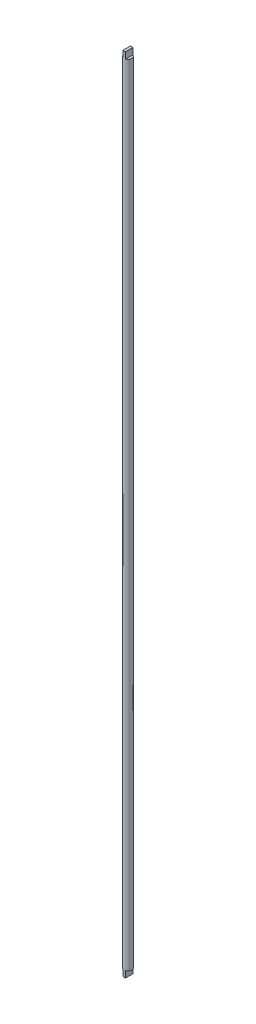
ISO-10303-21;
HEADER;
FILE_DESCRIPTION(('STEP AP214'),'2;1');
FILE_NAME('part.step','',(''),(''),'','','');
FILE_SCHEMA(('AUTOMOTIVE_DESIGN { 1 0 10303 214 1 1 1 1 }'));
ENDSEC;
DATA;
#1=APPLICATION_CONTEXT('core data for automotive mechanical design processes');
#2=APPLICATION_PROTOCOL_DEFINITION('international standard','automotive_design',2000,#1);
#3=PRODUCT_CONTEXT('',#1,'mechanical');
#4=PRODUCT('Part','Part','',(#3));
#5=PRODUCT_RELATED_PRODUCT_CATEGORY('part','',(#4));
#6=PRODUCT_DEFINITION_FORMATION('','',#4);
#7=PRODUCT_DEFINITION_CONTEXT('part definition',#1,'design');
#8=PRODUCT_DEFINITION('design','',#6,#7);
#9=PRODUCT_DEFINITION_SHAPE('','',#8);
#10=(LENGTH_UNIT() NAMED_UNIT(*) SI_UNIT(.MILLI.,.METRE.));
#11=(NAMED_UNIT(*) PLANE_ANGLE_UNIT() SI_UNIT($,.RADIAN.));
#12=(NAMED_UNIT(*) SI_UNIT($,.STERADIAN.) SOLID_ANGLE_UNIT());
#13=UNCERTAINTY_MEASURE_WITH_UNIT(LENGTH_MEASURE(1.E-05),#10,'distance_accuracy_value','');
#14=(GEOMETRIC_REPRESENTATION_CONTEXT(3) GLOBAL_UNCERTAINTY_ASSIGNED_CONTEXT((#13)) GLOBAL_UNIT_ASSIGNED_CONTEXT((#10,
#11,#12)) REPRESENTATION_CONTEXT('',''));
#15=CARTESIAN_POINT('',(0.,0.,0.));
#16=DIRECTION('',(0.,0.,1.));
#17=DIRECTION('',(1.,0.,0.));
#18=AXIS2_PLACEMENT_3D('',#15,#16,#17);
#19=CARTESIAN_POINT('',(0.,616.37,0.));
#20=DIRECTION('',(0.,-1.,0.));
#21=DIRECTION('',(0.,0.,-1.));
#22=AXIS2_PLACEMENT_3D('',#19,#20,#21);
#23=CYLINDRICAL_SURFACE('',#22,3.);
#24=CARTESIAN_POINT('',(0.,616.37,0.));
#25=DIRECTION('',(0.,1.,0.));
#26=DIRECTION('',(0.,0.,1.));
#27=AXIS2_PLACEMENT_3D('',#24,#25,#26);
#28=CIRCLE('',#27,3.);
#29=CARTESIAN_POINT('',(-1.,616.37,-2.82842712474619));
#30=VERTEX_POINT('',#29);
#31=CARTESIAN_POINT('',(-1.,616.37,2.82842712474619));
#32=VERTEX_POINT('',#31);
#33=EDGE_CURVE('E43',#30,#32,#28,.T.);
#34=ORIENTED_EDGE('',*,*,#33,.F.);
#35=DIRECTION('',(0.,-1.,0.));
#36=VECTOR('',#35,1.);
#37=CARTESIAN_POINT('',(-1.,621.37,-2.82842712474619));
#38=LINE('',#37,#36);
#39=CARTESIAN_POINT('',(-1.,621.37,-2.82842712474619));
#40=VERTEX_POINT('',#39);
#41=EDGE_CURVE('E143',#40,#30,#38,.T.);
#42=ORIENTED_EDGE('',*,*,#41,.F.);
#43=CARTESIAN_POINT('',(0.,621.37,0.));
#44=DIRECTION('',(0.,1.,0.));
#45=DIRECTION('',(0.,0.,1.));
#46=AXIS2_PLACEMENT_3D('',#43,#44,#45);
#47=CIRCLE('',#46,3.);
#48=CARTESIAN_POINT('',(1.,621.37,-2.82842712474619));
#49=VERTEX_POINT('',#48);
#50=EDGE_CURVE('E132',#49,#40,#47,.T.);
#51=ORIENTED_EDGE('',*,*,#50,.F.);
#52=DIRECTION('',(0.,-1.,0.));
#53=VECTOR('',#52,1.);
#54=CARTESIAN_POINT('',(1.,621.37,-2.82842712474619));
#55=LINE('',#54,#53);
#56=CARTESIAN_POINT('',(1.,616.37,-2.82842712474619));
#57=VERTEX_POINT('',#56);
#58=EDGE_CURVE('E146',#49,#57,#55,.T.);
#59=ORIENTED_EDGE('',*,*,#58,.T.);
#60=CARTESIAN_POINT('',(1.,616.37,2.82842712474619));
#61=VERTEX_POINT('',#60);
#62=EDGE_CURVE('E11',#61,#57,#28,.T.);
#63=ORIENTED_EDGE('',*,*,#62,.F.);
#64=DIRECTION('',(0.,-1.,0.));
#65=VECTOR('',#64,1.);
#66=CARTESIAN_POINT('',(1.,621.37,2.82842712474619));
#67=LINE('',#66,#65);
#68=CARTESIAN_POINT('',(1.,621.37,2.82842712474619));
#69=VERTEX_POINT('',#68);
#70=EDGE_CURVE('E149',#69,#61,#67,.T.);
#71=ORIENTED_EDGE('',*,*,#70,.F.);
#72=CARTESIAN_POINT('',(-1.,621.37,2.82842712474619));
#73=VERTEX_POINT('',#72);
#74=EDGE_CURVE('E127',#73,#69,#47,.T.);
#75=ORIENTED_EDGE('',*,*,#74,.F.);
#76=DIRECTION('',(0.,-1.,0.));
#77=VECTOR('',#76,1.);
#78=CARTESIAN_POINT('',(-1.,621.37,2.82842712474619));
#79=LINE('',#78,#77);
#80=EDGE_CURVE('E137',#73,#32,#79,.T.);
#81=ORIENTED_EDGE('',*,*,#80,.T.);
#82=EDGE_LOOP('',(#34,#42,#51,#59,#63,#71,#75,#81));
#83=FACE_BOUND('',#82,.T.);
#84=CARTESIAN_POINT('',(0.,-5.00000000000001,0.));
#85=DIRECTION('',(0.,-1.,0.));
#86=DIRECTION('',(0.,0.,-1.));
#87=AXIS2_PLACEMENT_3D('',#84,#85,#86);
#88=CIRCLE('',#87,3.);
#89=CARTESIAN_POINT('',(1.,-5.00000000000001,2.82842712474619));
#90=VERTEX_POINT('',#89);
#91=CARTESIAN_POINT('',(-1.,-5.00000000000001,2.82842712474619));
#92=VERTEX_POINT('',#91);
#93=EDGE_CURVE('E50',#90,#92,#88,.T.);
#94=ORIENTED_EDGE('',*,*,#93,.F.);
#95=DIRECTION('',(0.,1.,0.));
#96=VECTOR('',#95,1.);
#97=CARTESIAN_POINT('',(1.,-20.27,2.82842712474619));
#98=LINE('',#97,#96);
#99=CARTESIAN_POINT('',(1.,0.,2.82842712474619));
#100=VERTEX_POINT('',#99);
#101=EDGE_CURVE('E111',#90,#100,#98,.T.);
#102=ORIENTED_EDGE('',*,*,#101,.T.);
#103=CARTESIAN_POINT('',(0.,0.,0.));
#104=DIRECTION('',(0.,1.,0.));
#105=DIRECTION('',(0.,0.,1.));
#106=AXIS2_PLACEMENT_3D('',#103,#104,#105);
#107=CIRCLE('',#106,3.);
#108=CARTESIAN_POINT('',(1.,0.,-2.82842712474619));
#109=VERTEX_POINT('',#108);
#110=EDGE_CURVE('E38',#100,#109,#107,.T.);
#111=ORIENTED_EDGE('',*,*,#110,.T.);
#112=DIRECTION('',(0.,1.,0.));
#113=VECTOR('',#112,1.);
#114=CARTESIAN_POINT('',(1.,-20.27,-2.82842712474619));
#115=LINE('',#114,#113);
#116=CARTESIAN_POINT('',(0.999999999999999,-5.00000000000001,-2.82842712474619));
#117=VERTEX_POINT('',#116);
#118=EDGE_CURVE('E109',#117,#109,#115,.T.);
#119=ORIENTED_EDGE('',*,*,#118,.F.);
#120=CARTESIAN_POINT('',(0.,-5.00000000000001,0.));
#121=DIRECTION('',(0.,-1.,0.));
#122=DIRECTION('',(0.,0.,-1.));
#123=AXIS2_PLACEMENT_3D('',#120,#121,#122);
#124=CIRCLE('',#123,3.);
#125=CARTESIAN_POINT('',(-1.,-5.00000000000001,-2.82842712474619));
#126=VERTEX_POINT('',#125);
#127=EDGE_CURVE('E98',#126,#117,#124,.T.);
#128=ORIENTED_EDGE('',*,*,#127,.F.);
#129=DIRECTION('',(0.,1.,0.));
#130=VECTOR('',#129,1.);
#131=CARTESIAN_POINT('',(-1.,-20.27,-2.82842712474619));
#132=LINE('',#131,#130);
#133=CARTESIAN_POINT('',(-1.,0.,-2.82842712474619));
#134=VERTEX_POINT('',#133);
#135=EDGE_CURVE('E58',#126,#134,#132,.T.);
#136=ORIENTED_EDGE('',*,*,#135,.T.);
#137=CARTESIAN_POINT('',(-1.,0.,2.82842712474619));
#138=VERTEX_POINT('',#137);
#139=EDGE_CURVE('E151',#134,#138,#107,.T.);
#140=ORIENTED_EDGE('',*,*,#139,.T.);
#141=DIRECTION('',(0.,1.,0.));
#142=VECTOR('',#141,1.);
#143=CARTESIAN_POINT('',(-1.,-20.27,2.82842712474619));
#144=LINE('',#143,#142);
#145=EDGE_CURVE('E116',#92,#138,#144,.T.);
#146=ORIENTED_EDGE('',*,*,#145,.F.);
#147=EDGE_LOOP('',(#94,#102,#111,#119,#128,#136,#140,#146));
#148=FACE_BOUND('',#147,.T.);
#149=ADVANCED_FACE('F35',(#83,#148),#23,.T.);
#150=CARTESIAN_POINT('',(1.,-20.27,0.));
#151=DIRECTION('',(1.,0.,0.));
#152=DIRECTION('',(0.,0.,-1.));
#153=AXIS2_PLACEMENT_3D('',#150,#151,#152);
#154=PLANE('',#153);
#155=ORIENTED_EDGE('',*,*,#101,.F.);
#156=DIRECTION('',(0.,0.,1.));
#157=VECTOR('',#156,1.);
#158=CARTESIAN_POINT('',(1.,-5.00000000000001,0.));
#159=LINE('',#158,#157);
#160=EDGE_CURVE('E101',#117,#90,#159,.T.);
#161=ORIENTED_EDGE('',*,*,#160,.F.);
#162=ORIENTED_EDGE('',*,*,#118,.T.);
#163=DIRECTION('',(0.,0.,-1.));
#164=VECTOR('',#163,1.);
#165=CARTESIAN_POINT('',(1.,0.,0.));
#166=LINE('',#165,#164);
#167=EDGE_CURVE('E124',#100,#109,#166,.T.);
#168=ORIENTED_EDGE('',*,*,#167,.F.);
#169=EDGE_LOOP('',(#155,#161,#162,#168));
#170=FACE_BOUND('',#169,.T.);
#171=ADVANCED_FACE('F107',(#170),#154,.T.);
#172=CARTESIAN_POINT('',(-1.,-20.27,0.));
#173=DIRECTION('',(-1.,0.,0.));
#174=DIRECTION('',(0.,0.,1.));
#175=AXIS2_PLACEMENT_3D('',#172,#173,#174);
#176=PLANE('',#175);
#177=ORIENTED_EDGE('',*,*,#135,.F.);
#178=DIRECTION('',(0.,0.,-1.));
#179=VECTOR('',#178,1.);
#180=CARTESIAN_POINT('',(-1.,-5.00000000000001,0.));
#181=LINE('',#180,#179);
#182=EDGE_CURVE('E102',#92,#126,#181,.T.);
#183=ORIENTED_EDGE('',*,*,#182,.F.);
#184=ORIENTED_EDGE('',*,*,#145,.T.);
#185=DIRECTION('',(0.,0.,1.));
#186=VECTOR('',#185,1.);
#187=CARTESIAN_POINT('',(-1.,0.,0.));
#188=LINE('',#187,#186);
#189=EDGE_CURVE('E121',#134,#138,#188,.T.);
#190=ORIENTED_EDGE('',*,*,#189,.F.);
#191=EDGE_LOOP('',(#177,#183,#184,#190));
#192=FACE_BOUND('',#191,.T.);
#193=ADVANCED_FACE('F188',(#192),#176,.T.);
#194=CARTESIAN_POINT('',(0.,0.,0.));
#195=DIRECTION('',(0.,1.,0.));
#196=DIRECTION('',(0.,0.,1.));
#197=AXIS2_PLACEMENT_3D('',#194,#195,#196);
#198=PLANE('',#197);
#199=ORIENTED_EDGE('',*,*,#110,.F.);
#200=ORIENTED_EDGE('',*,*,#167,.T.);
#201=EDGE_LOOP('',(#199,#200));
#202=FACE_BOUND('',#201,.T.);
#203=ADVANCED_FACE('F182',(#202),#198,.F.);
#204=CARTESIAN_POINT('',(0.,616.37,0.));
#205=DIRECTION('',(0.,1.,0.));
#206=DIRECTION('',(0.,0.,1.));
#207=AXIS2_PLACEMENT_3D('',#204,#205,#206);
#208=PLANE('',#207);
#209=ORIENTED_EDGE('',*,*,#33,.T.);
#210=DIRECTION('',(0.,0.,-1.));
#211=VECTOR('',#210,1.);
#212=CARTESIAN_POINT('',(-1.,616.37,0.));
#213=LINE('',#212,#211);
#214=EDGE_CURVE('E131',#32,#30,#213,.T.);
#215=ORIENTED_EDGE('',*,*,#214,.T.);
#216=EDGE_LOOP('',(#209,#215));
#217=FACE_BOUND('',#216,.T.);
#218=ADVANCED_FACE('F158',(#217),#208,.T.);
#219=DIRECTION('',(0.,0.,-1.));
#220=VECTOR('',#219,1.);
#221=CARTESIAN_POINT('',(1.,616.37,0.));
#222=LINE('',#221,#220);
#223=EDGE_CURVE('E126',#61,#57,#222,.T.);
#224=ORIENTED_EDGE('',*,*,#223,.F.);
#225=ORIENTED_EDGE('',*,*,#62,.T.);
#226=EDGE_LOOP('',(#224,#225));
#227=FACE_BOUND('',#226,.T.);
#228=ADVANCED_FACE('F173',(#227),#208,.T.);
#229=ORIENTED_EDGE('',*,*,#139,.F.);
#230=ORIENTED_EDGE('',*,*,#189,.T.);
#231=EDGE_LOOP('',(#229,#230));
#232=FACE_BOUND('',#231,.T.);
#233=ADVANCED_FACE('F175',(#232),#198,.F.);
#234=CARTESIAN_POINT('',(1.,621.37,0.));
#235=DIRECTION('',(-1.,0.,0.));
#236=DIRECTION('',(0.,0.,1.));
#237=AXIS2_PLACEMENT_3D('',#234,#235,#236);
#238=PLANE('',#237);
#239=ORIENTED_EDGE('',*,*,#223,.T.);
#240=ORIENTED_EDGE('',*,*,#58,.F.);
#241=DIRECTION('',(0.,0.,-1.));
#242=VECTOR('',#241,1.);
#243=CARTESIAN_POINT('',(1.,621.37,0.));
#244=LINE('',#243,#242);
#245=EDGE_CURVE('E130',#69,#49,#244,.T.);
#246=ORIENTED_EDGE('',*,*,#245,.F.);
#247=ORIENTED_EDGE('',*,*,#70,.T.);
#248=EDGE_LOOP('',(#239,#240,#246,#247));
#249=FACE_BOUND('',#248,.T.);
#250=ADVANCED_FACE('F171',(#249),#238,.F.);
#251=CARTESIAN_POINT('',(-1.,621.37,0.));
#252=DIRECTION('',(-1.,0.,0.));
#253=DIRECTION('',(0.,0.,1.));
#254=AXIS2_PLACEMENT_3D('',#251,#252,#253);
#255=PLANE('',#254);
#256=ORIENTED_EDGE('',*,*,#214,.F.);
#257=ORIENTED_EDGE('',*,*,#80,.F.);
#258=DIRECTION('',(0.,0.,-1.));
#259=VECTOR('',#258,1.);
#260=CARTESIAN_POINT('',(-1.,621.37,0.));
#261=LINE('',#260,#259);
#262=EDGE_CURVE('E134',#73,#40,#261,.T.);
#263=ORIENTED_EDGE('',*,*,#262,.T.);
#264=ORIENTED_EDGE('',*,*,#41,.T.);
#265=EDGE_LOOP('',(#256,#257,#263,#264));
#266=FACE_BOUND('',#265,.T.);
#267=ADVANCED_FACE('F165',(#266),#255,.T.);
#268=CARTESIAN_POINT('',(0.,621.37,0.));
#269=DIRECTION('',(0.,1.,0.));
#270=DIRECTION('',(0.,0.,1.));
#271=AXIS2_PLACEMENT_3D('',#268,#269,#270);
#272=PLANE('',#271);
#273=ORIENTED_EDGE('',*,*,#74,.T.);
#274=ORIENTED_EDGE('',*,*,#245,.T.);
#275=ORIENTED_EDGE('',*,*,#50,.T.);
#276=ORIENTED_EDGE('',*,*,#262,.F.);
#277=EDGE_LOOP('',(#273,#274,#275,#276));
#278=FACE_BOUND('',#277,.T.);
#279=ADVANCED_FACE('F170',(#278),#272,.T.);
#280=CARTESIAN_POINT('',(0.,-5.00000000000001,0.));
#281=DIRECTION('',(0.,-1.,0.));
#282=DIRECTION('',(0.,0.,-1.));
#283=AXIS2_PLACEMENT_3D('',#280,#281,#282);
#284=PLANE('',#283);
#285=ORIENTED_EDGE('',*,*,#127,.T.);
#286=ORIENTED_EDGE('',*,*,#160,.T.);
#287=ORIENTED_EDGE('',*,*,#93,.T.);
#288=ORIENTED_EDGE('',*,*,#182,.T.);
#289=EDGE_LOOP('',(#285,#286,#287,#288));
#290=FACE_BOUND('',#289,.T.);
#291=ADVANCED_FACE('F100',(#290),#284,.T.);
#292=CLOSED_SHELL('',(#149,#171,#193,#203,#218,#228,#233,#250,#267,#279,#291));
#293=MANIFOLD_SOLID_BREP('B2',#292);
#294=ADVANCED_BREP_SHAPE_REPRESENTATION('',(#18,#293),#14);
#295=SHAPE_DEFINITION_REPRESENTATION(#9,#294);
ENDSEC;
END-ISO-10303-21;
